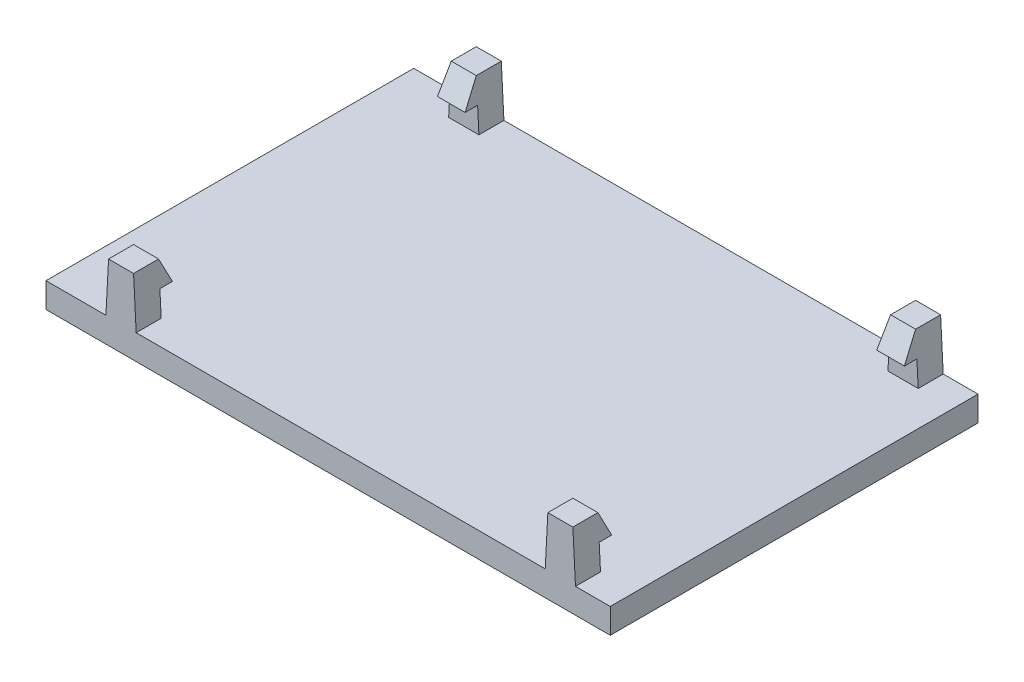
ISO-10303-21;
HEADER;
FILE_DESCRIPTION(('STEP AP214'),'2;1');
FILE_NAME('part.step','',(''),(''),'','','');
FILE_SCHEMA(('AUTOMOTIVE_DESIGN { 1 0 10303 214 1 1 1 1 }'));
ENDSEC;
DATA;
#1=APPLICATION_CONTEXT('core data for automotive mechanical design processes');
#2=APPLICATION_PROTOCOL_DEFINITION('international standard','automotive_design',2000,#1);
#3=PRODUCT_CONTEXT('',#1,'mechanical');
#4=PRODUCT('Part','Part','',(#3));
#5=PRODUCT_RELATED_PRODUCT_CATEGORY('part','',(#4));
#6=PRODUCT_DEFINITION_FORMATION('','',#4);
#7=PRODUCT_DEFINITION_CONTEXT('part definition',#1,'design');
#8=PRODUCT_DEFINITION('design','',#6,#7);
#9=PRODUCT_DEFINITION_SHAPE('','',#8);
#10=(LENGTH_UNIT() NAMED_UNIT(*) SI_UNIT(.MILLI.,.METRE.));
#11=(NAMED_UNIT(*) PLANE_ANGLE_UNIT() SI_UNIT($,.RADIAN.));
#12=(NAMED_UNIT(*) SI_UNIT($,.STERADIAN.) SOLID_ANGLE_UNIT());
#13=UNCERTAINTY_MEASURE_WITH_UNIT(LENGTH_MEASURE(1.E-05),#10,'distance_accuracy_value','');
#14=(GEOMETRIC_REPRESENTATION_CONTEXT(3) GLOBAL_UNCERTAINTY_ASSIGNED_CONTEXT((#13)) GLOBAL_UNIT_ASSIGNED_CONTEXT((#10,
#11,#12)) REPRESENTATION_CONTEXT('',''));
#15=CARTESIAN_POINT('',(0.,0.,0.));
#16=DIRECTION('',(0.,0.,1.));
#17=DIRECTION('',(1.,0.,0.));
#18=AXIS2_PLACEMENT_3D('',#15,#16,#17);
#19=CARTESIAN_POINT('',(0.,1.,0.));
#20=DIRECTION('',(0.,1.,0.));
#21=DIRECTION('',(0.,0.,1.));
#22=AXIS2_PLACEMENT_3D('',#19,#20,#21);
#23=PLANE('',#22);
#24=DIRECTION('',(0.,0.,-1.));
#25=VECTOR('',#24,1.);
#26=CARTESIAN_POINT('',(-26.6896558318944,1.,34.9634280180762));
#27=LINE('',#26,#25);
#28=CARTESIAN_POINT('',(-26.6896558318944,1.,34.9634280180762));
#29=VERTEX_POINT('',#28);
#30=CARTESIAN_POINT('',(-26.6896558318944,1.,33.9634280180762));
#31=VERTEX_POINT('',#30);
#32=EDGE_CURVE('E50',#29,#31,#27,.T.);
#33=ORIENTED_EDGE('',*,*,#32,.T.);
#34=DIRECTION('',(1.,0.,0.));
#35=VECTOR('',#34,1.);
#36=CARTESIAN_POINT('',(-26.0848402733283,1.,33.9634280180762));
#37=LINE('',#36,#35);
#38=CARTESIAN_POINT('',(-25.4800247147623,1.,33.9634280180762));
#39=VERTEX_POINT('',#38);
#40=EDGE_CURVE('E54',#31,#39,#37,.T.);
#41=ORIENTED_EDGE('',*,*,#40,.T.);
#42=DIRECTION('',(0.,0.,1.));
#43=VECTOR('',#42,1.);
#44=CARTESIAN_POINT('',(-25.4800247147623,1.,34.9634280180762));
#45=LINE('',#44,#43);
#46=CARTESIAN_POINT('',(-25.4800247147623,1.,34.9634280180762));
#47=VERTEX_POINT('',#46);
#48=EDGE_CURVE('E250',#39,#47,#45,.T.);
#49=ORIENTED_EDGE('',*,*,#48,.T.);
#50=DIRECTION('',(1.,0.,0.));
#51=VECTOR('',#50,1.);
#52=CARTESIAN_POINT('',(-46.6448402733285,1.,34.9634280180762));
#53=LINE('',#52,#51);
#54=CARTESIAN_POINT('',(-24.0896402733285,1.,34.9634280180762));
#55=VERTEX_POINT('',#54);
#56=EDGE_CURVE('E409',#47,#55,#53,.T.);
#57=ORIENTED_EDGE('',*,*,#56,.T.);
#58=DIRECTION('',(0.,0.,-1.));
#59=VECTOR('',#58,1.);
#60=CARTESIAN_POINT('',(-24.0896402733285,1.,20.2634280180762));
#61=LINE('',#60,#59);
#62=CARTESIAN_POINT('',(-24.0896402733285,1.,20.2634280180762));
#63=VERTEX_POINT('',#62);
#64=EDGE_CURVE('E413',#55,#63,#61,.T.);
#65=ORIENTED_EDGE('',*,*,#64,.T.);
#66=DIRECTION('',(-1.,0.,0.));
#67=VECTOR('',#66,1.);
#68=CARTESIAN_POINT('',(-46.6448402733285,1.,20.2634280180762));
#69=LINE('',#68,#67);
#70=CARTESIAN_POINT('',(-25.4800247147624,1.,20.2634280180762));
#71=VERTEX_POINT('',#70);
#72=EDGE_CURVE('E423',#63,#71,#69,.T.);
#73=ORIENTED_EDGE('',*,*,#72,.T.);
#74=DIRECTION('',(0.,0.,1.));
#75=VECTOR('',#74,1.);
#76=CARTESIAN_POINT('',(-25.4800247147624,1.,20.2634280180762));
#77=LINE('',#76,#75);
#78=CARTESIAN_POINT('',(-25.4800247147624,1.,21.2634280180762));
#79=VERTEX_POINT('',#78);
#80=EDGE_CURVE('E331',#71,#79,#77,.T.);
#81=ORIENTED_EDGE('',*,*,#80,.T.);
#82=DIRECTION('',(-1.,0.,0.));
#83=VECTOR('',#82,1.);
#84=CARTESIAN_POINT('',(-26.0848402733285,1.,21.2634280180762));
#85=LINE('',#84,#83);
#86=CARTESIAN_POINT('',(-26.6896558318946,1.,21.2634280180762));
#87=VERTEX_POINT('',#86);
#88=EDGE_CURVE('E320',#79,#87,#85,.T.);
#89=ORIENTED_EDGE('',*,*,#88,.T.);
#90=DIRECTION('',(0.,0.,-1.));
#91=VECTOR('',#90,1.);
#92=CARTESIAN_POINT('',(-26.6896558318946,1.,20.2634280180762));
#93=LINE('',#92,#91);
#94=CARTESIAN_POINT('',(-26.6896558318946,0.999999999999999,20.2634280180762));
#95=VERTEX_POINT('',#94);
#96=EDGE_CURVE('E316',#87,#95,#93,.T.);
#97=ORIENTED_EDGE('',*,*,#96,.T.);
#98=CARTESIAN_POINT('',(-43.0400247147624,1.,20.2634280180762));
#99=VERTEX_POINT('',#98);
#100=EDGE_CURVE('E36',#95,#99,#69,.T.);
#101=ORIENTED_EDGE('',*,*,#100,.T.);
#102=DIRECTION('',(0.,0.,1.));
#103=VECTOR('',#102,1.);
#104=CARTESIAN_POINT('',(-43.0400247147624,1.,20.2634280180762));
#105=LINE('',#104,#103);
#106=CARTESIAN_POINT('',(-43.0400247147624,1.,21.2634280180762));
#107=VERTEX_POINT('',#106);
#108=EDGE_CURVE('E374',#99,#107,#105,.T.);
#109=ORIENTED_EDGE('',*,*,#108,.T.);
#110=DIRECTION('',(-1.,0.,0.));
#111=VECTOR('',#110,1.);
#112=CARTESIAN_POINT('',(-43.6448402733285,1.,21.2634280180762));
#113=LINE('',#112,#111);
#114=CARTESIAN_POINT('',(-44.2496558318946,0.999999999999999,21.2634280180762));
#115=VERTEX_POINT('',#114);
#116=EDGE_CURVE('E371',#107,#115,#113,.T.);
#117=ORIENTED_EDGE('',*,*,#116,.T.);
#118=DIRECTION('',(0.,0.,-1.));
#119=VECTOR('',#118,1.);
#120=CARTESIAN_POINT('',(-44.2496558318946,1.,20.2634280180762));
#121=LINE('',#120,#119);
#122=CARTESIAN_POINT('',(-44.2496558318946,1.,20.2634280180762));
#123=VERTEX_POINT('',#122);
#124=EDGE_CURVE('E366',#115,#123,#121,.T.);
#125=ORIENTED_EDGE('',*,*,#124,.T.);
#126=CARTESIAN_POINT('',(-46.6448402733285,1.,20.2634280180762));
#127=VERTEX_POINT('',#126);
#128=EDGE_CURVE('E415',#123,#127,#69,.T.);
#129=ORIENTED_EDGE('',*,*,#128,.T.);
#130=DIRECTION('',(0.,0.,1.));
#131=VECTOR('',#130,1.);
#132=CARTESIAN_POINT('',(-46.6448402733285,1.,20.2634280180762));
#133=LINE('',#132,#131);
#134=CARTESIAN_POINT('',(-46.6448402733285,1.,34.9634280180762));
#135=VERTEX_POINT('',#134);
#136=EDGE_CURVE('E406',#127,#135,#133,.T.);
#137=ORIENTED_EDGE('',*,*,#136,.T.);
#138=CARTESIAN_POINT('',(-44.2496558318944,1.,34.9634280180762));
#139=VERTEX_POINT('',#138);
#140=EDGE_CURVE('E411',#135,#139,#53,.T.);
#141=ORIENTED_EDGE('',*,*,#140,.T.);
#142=DIRECTION('',(0.,0.,-1.));
#143=VECTOR('',#142,1.);
#144=CARTESIAN_POINT('',(-44.2496558318944,1.,34.9634280180762));
#145=LINE('',#144,#143);
#146=CARTESIAN_POINT('',(-44.2496558318944,1.,33.9634280180762));
#147=VERTEX_POINT('',#146);
#148=EDGE_CURVE('E285',#139,#147,#145,.T.);
#149=ORIENTED_EDGE('',*,*,#148,.T.);
#150=DIRECTION('',(1.,0.,0.));
#151=VECTOR('',#150,1.);
#152=CARTESIAN_POINT('',(-43.6448402733283,1.,33.9634280180762));
#153=LINE('',#152,#151);
#154=CARTESIAN_POINT('',(-43.0400247147623,1.,33.9634280180762));
#155=VERTEX_POINT('',#154);
#156=EDGE_CURVE('E274',#147,#155,#153,.T.);
#157=ORIENTED_EDGE('',*,*,#156,.T.);
#158=DIRECTION('',(0.,0.,1.));
#159=VECTOR('',#158,1.);
#160=CARTESIAN_POINT('',(-43.0400247147623,1.,34.9634280180762));
#161=LINE('',#160,#159);
#162=CARTESIAN_POINT('',(-43.0400247147623,1.,34.9634280180762));
#163=VERTEX_POINT('',#162);
#164=EDGE_CURVE('E270',#155,#163,#161,.T.);
#165=ORIENTED_EDGE('',*,*,#164,.T.);
#166=EDGE_CURVE('E414',#163,#29,#53,.T.);
#167=ORIENTED_EDGE('',*,*,#166,.T.);
#168=EDGE_LOOP('',(#33,#41,#49,#57,#65,#73,#81,#89,#97,#101,#109,#117,#125,#129,#137,#141,#149,
#157,#165,#167));
#169=FACE_BOUND('',#168,.T.);
#170=ADVANCED_FACE('F32',(#169),#23,.T.);
#171=CARTESIAN_POINT('',(-46.6448402733285,1.,20.2634280180762));
#172=DIRECTION('',(1.,0.,0.));
#173=DIRECTION('',(0.,0.,-1.));
#174=AXIS2_PLACEMENT_3D('',#171,#172,#173);
#175=PLANE('',#174);
#176=DIRECTION('',(0.,0.,1.));
#177=VECTOR('',#176,1.);
#178=CARTESIAN_POINT('',(-46.6448402733285,0.,20.2634280180762));
#179=LINE('',#178,#177);
#180=CARTESIAN_POINT('',(-46.6448402733285,0.,20.2634280180762));
#181=VERTEX_POINT('',#180);
#182=CARTESIAN_POINT('',(-46.6448402733285,0.,34.9634280180762));
#183=VERTEX_POINT('',#182);
#184=EDGE_CURVE('E370',#181,#183,#179,.T.);
#185=ORIENTED_EDGE('',*,*,#184,.T.);
#186=DIRECTION('',(0.,-1.,0.));
#187=VECTOR('',#186,1.);
#188=CARTESIAN_POINT('',(-46.6448402733285,1.,34.9634280180762));
#189=LINE('',#188,#187);
#190=EDGE_CURVE('E11',#135,#183,#189,.T.);
#191=ORIENTED_EDGE('',*,*,#190,.F.);
#192=ORIENTED_EDGE('',*,*,#136,.F.);
#193=DIRECTION('',(0.,-1.,0.));
#194=VECTOR('',#193,1.);
#195=CARTESIAN_POINT('',(-46.6448402733285,1.,20.2634280180762));
#196=LINE('',#195,#194);
#197=EDGE_CURVE('E424',#127,#181,#196,.T.);
#198=ORIENTED_EDGE('',*,*,#197,.T.);
#199=EDGE_LOOP('',(#185,#191,#192,#198));
#200=FACE_BOUND('',#199,.T.);
#201=ADVANCED_FACE('F34',(#200),#175,.F.);
#202=CARTESIAN_POINT('',(-46.6448402733285,1.,34.9634280180762));
#203=DIRECTION('',(0.,0.,-1.));
#204=DIRECTION('',(-1.,0.,0.));
#205=AXIS2_PLACEMENT_3D('',#202,#203,#204);
#206=PLANE('',#205);
#207=DIRECTION('',(1.,0.,0.));
#208=VECTOR('',#207,1.);
#209=CARTESIAN_POINT('',(-46.6448402733285,0.,34.9634280180762));
#210=LINE('',#209,#208);
#211=CARTESIAN_POINT('',(-24.0896402733285,0.,34.9634280180762));
#212=VERTEX_POINT('',#211);
#213=EDGE_CURVE('E435',#183,#212,#210,.T.);
#214=ORIENTED_EDGE('',*,*,#213,.T.);
#215=DIRECTION('',(0.,-1.,0.));
#216=VECTOR('',#215,1.);
#217=CARTESIAN_POINT('',(-24.0896402733285,1.,34.9634280180762));
#218=LINE('',#217,#216);
#219=EDGE_CURVE('E42',#55,#212,#218,.T.);
#220=ORIENTED_EDGE('',*,*,#219,.F.);
#221=ORIENTED_EDGE('',*,*,#56,.F.);
#222=DIRECTION('',(-0.0523359562429438,0.998629534754574,0.));
#223=VECTOR('',#222,1.);
#224=CARTESIAN_POINT('',(-25.5848402733283,3.,34.9634280180762));
#225=LINE('',#224,#223);
#226=CARTESIAN_POINT('',(-25.5848402733283,3.,34.9634280180762));
#227=VERTEX_POINT('',#226);
#228=EDGE_CURVE('E260',#47,#227,#225,.T.);
#229=ORIENTED_EDGE('',*,*,#228,.T.);
#230=DIRECTION('',(-1.,0.,0.));
#231=VECTOR('',#230,1.);
#232=CARTESIAN_POINT('',(-26.0848402733283,3.,34.9634280180762));
#233=LINE('',#232,#231);
#234=CARTESIAN_POINT('',(-26.5848402733283,3.,34.9634280180762));
#235=VERTEX_POINT('',#234);
#236=EDGE_CURVE('E247',#227,#235,#233,.T.);
#237=ORIENTED_EDGE('',*,*,#236,.T.);
#238=DIRECTION('',(-0.0523359562429438,-0.998629534754574,0.));
#239=VECTOR('',#238,1.);
#240=CARTESIAN_POINT('',(-26.5848402733283,3.,34.9634280180762));
#241=LINE('',#240,#239);
#242=EDGE_CURVE('E244',#235,#29,#241,.T.);
#243=ORIENTED_EDGE('',*,*,#242,.T.);
#244=ORIENTED_EDGE('',*,*,#166,.F.);
#245=DIRECTION('',(-0.0523359562429438,0.998629534754574,0.));
#246=VECTOR('',#245,1.);
#247=CARTESIAN_POINT('',(-43.1448402733283,3.,34.9634280180762));
#248=LINE('',#247,#246);
#249=CARTESIAN_POINT('',(-43.1448402733283,3.,34.9634280180762));
#250=VERTEX_POINT('',#249);
#251=EDGE_CURVE('E301',#163,#250,#248,.T.);
#252=ORIENTED_EDGE('',*,*,#251,.T.);
#253=DIRECTION('',(-1.,0.,0.));
#254=VECTOR('',#253,1.);
#255=CARTESIAN_POINT('',(-43.6448402733283,3.,34.9634280180762));
#256=LINE('',#255,#254);
#257=CARTESIAN_POINT('',(-44.1448402733283,3.,34.9634280180762));
#258=VERTEX_POINT('',#257);
#259=EDGE_CURVE('E302',#250,#258,#256,.T.);
#260=ORIENTED_EDGE('',*,*,#259,.T.);
#261=DIRECTION('',(-0.0523359562429438,-0.998629534754574,0.));
#262=VECTOR('',#261,1.);
#263=CARTESIAN_POINT('',(-44.1448402733283,3.,34.9634280180762));
#264=LINE('',#263,#262);
#265=EDGE_CURVE('E279',#258,#139,#264,.T.);
#266=ORIENTED_EDGE('',*,*,#265,.T.);
#267=ORIENTED_EDGE('',*,*,#140,.F.);
#268=ORIENTED_EDGE('',*,*,#190,.T.);
#269=EDGE_LOOP('',(#214,#220,#221,#229,#237,#243,#244,#252,#260,#266,#267,#268));
#270=FACE_BOUND('',#269,.T.);
#271=ADVANCED_FACE('F448',(#270),#206,.F.);
#272=CARTESIAN_POINT('',(-24.0896402733285,1.,20.2634280180762));
#273=DIRECTION('',(-1.,0.,0.));
#274=DIRECTION('',(0.,0.,1.));
#275=AXIS2_PLACEMENT_3D('',#272,#273,#274);
#276=PLANE('',#275);
#277=DIRECTION('',(0.,0.,-1.));
#278=VECTOR('',#277,1.);
#279=CARTESIAN_POINT('',(-24.0896402733285,0.,20.2634280180762));
#280=LINE('',#279,#278);
#281=CARTESIAN_POINT('',(-24.0896402733285,0.,20.2634280180762));
#282=VERTEX_POINT('',#281);
#283=EDGE_CURVE('E434',#212,#282,#280,.T.);
#284=ORIENTED_EDGE('',*,*,#283,.T.);
#285=DIRECTION('',(0.,-1.,0.));
#286=VECTOR('',#285,1.);
#287=CARTESIAN_POINT('',(-24.0896402733285,1.,20.2634280180762));
#288=LINE('',#287,#286);
#289=EDGE_CURVE('E428',#63,#282,#288,.T.);
#290=ORIENTED_EDGE('',*,*,#289,.F.);
#291=ORIENTED_EDGE('',*,*,#64,.F.);
#292=ORIENTED_EDGE('',*,*,#219,.T.);
#293=EDGE_LOOP('',(#284,#290,#291,#292));
#294=FACE_BOUND('',#293,.T.);
#295=ADVANCED_FACE('F457',(#294),#276,.F.);
#296=CARTESIAN_POINT('',(-46.6448402733285,1.,20.2634280180762));
#297=DIRECTION('',(0.,0.,1.));
#298=DIRECTION('',(1.,0.,0.));
#299=AXIS2_PLACEMENT_3D('',#296,#297,#298);
#300=PLANE('',#299);
#301=DIRECTION('',(-1.,0.,0.));
#302=VECTOR('',#301,1.);
#303=CARTESIAN_POINT('',(-46.6448402733285,0.,20.2634280180762));
#304=LINE('',#303,#302);
#305=EDGE_CURVE('E410',#282,#181,#304,.T.);
#306=ORIENTED_EDGE('',*,*,#305,.T.);
#307=ORIENTED_EDGE('',*,*,#197,.F.);
#308=ORIENTED_EDGE('',*,*,#128,.F.);
#309=DIRECTION('',(0.0523359562429438,0.998629534754574,0.));
#310=VECTOR('',#309,1.);
#311=CARTESIAN_POINT('',(-44.1448402733285,3.,20.2634280180762));
#312=LINE('',#311,#310);
#313=CARTESIAN_POINT('',(-44.1448402733285,3.,20.2634280180762));
#314=VERTEX_POINT('',#313);
#315=EDGE_CURVE('E388',#123,#314,#312,.T.);
#316=ORIENTED_EDGE('',*,*,#315,.T.);
#317=DIRECTION('',(1.,0.,0.));
#318=VECTOR('',#317,1.);
#319=CARTESIAN_POINT('',(-43.6448402733285,3.,20.2634280180762));
#320=LINE('',#319,#318);
#321=CARTESIAN_POINT('',(-43.1448402733285,3.,20.2634280180762));
#322=VERTEX_POINT('',#321);
#323=EDGE_CURVE('E382',#314,#322,#320,.T.);
#324=ORIENTED_EDGE('',*,*,#323,.T.);
#325=DIRECTION('',(0.0523359562429438,-0.998629534754574,0.));
#326=VECTOR('',#325,1.);
#327=CARTESIAN_POINT('',(-43.1448402733285,3.,20.2634280180762));
#328=LINE('',#327,#326);
#329=EDGE_CURVE('E380',#322,#99,#328,.T.);
#330=ORIENTED_EDGE('',*,*,#329,.T.);
#331=ORIENTED_EDGE('',*,*,#100,.F.);
#332=DIRECTION('',(0.0523359562429438,0.998629534754574,0.));
#333=VECTOR('',#332,1.);
#334=CARTESIAN_POINT('',(-26.5848402733285,3.,20.2634280180762));
#335=LINE('',#334,#333);
#336=CARTESIAN_POINT('',(-26.5848402733285,3.,20.2634280180762));
#337=VERTEX_POINT('',#336);
#338=EDGE_CURVE('E347',#95,#337,#335,.T.);
#339=ORIENTED_EDGE('',*,*,#338,.T.);
#340=DIRECTION('',(1.,0.,0.));
#341=VECTOR('',#340,1.);
#342=CARTESIAN_POINT('',(-26.0848402733285,3.,20.2634280180762));
#343=LINE('',#342,#341);
#344=CARTESIAN_POINT('',(-25.5848402733285,3.,20.2634280180762));
#345=VERTEX_POINT('',#344);
#346=EDGE_CURVE('E348',#337,#345,#343,.T.);
#347=ORIENTED_EDGE('',*,*,#346,.T.);
#348=DIRECTION('',(0.0523359562429438,-0.998629534754574,0.));
#349=VECTOR('',#348,1.);
#350=CARTESIAN_POINT('',(-25.5848402733285,3.,20.2634280180762));
#351=LINE('',#350,#349);
#352=EDGE_CURVE('E325',#345,#71,#351,.T.);
#353=ORIENTED_EDGE('',*,*,#352,.T.);
#354=ORIENTED_EDGE('',*,*,#72,.F.);
#355=ORIENTED_EDGE('',*,*,#289,.T.);
#356=EDGE_LOOP('',(#306,#307,#308,#316,#324,#330,#331,#339,#347,#353,#354,#355));
#357=FACE_BOUND('',#356,.T.);
#358=ADVANCED_FACE('F452',(#357),#300,.F.);
#359=CARTESIAN_POINT('',(0.,0.,0.));
#360=DIRECTION('',(0.,1.,0.));
#361=DIRECTION('',(0.,0.,1.));
#362=AXIS2_PLACEMENT_3D('',#359,#360,#361);
#363=PLANE('',#362);
#364=ORIENTED_EDGE('',*,*,#184,.F.);
#365=ORIENTED_EDGE('',*,*,#305,.F.);
#366=ORIENTED_EDGE('',*,*,#283,.F.);
#367=ORIENTED_EDGE('',*,*,#213,.F.);
#368=EDGE_LOOP('',(#364,#365,#366,#367));
#369=FACE_BOUND('',#368,.T.);
#370=ADVANCED_FACE('F446',(#369),#363,.F.);
#371=CARTESIAN_POINT('',(-43.6448402733285,-498.,21.2634280180762));
#372=DIRECTION('',(0.,0.,1.));
#373=DIRECTION('',(-1.,0.,0.));
#374=AXIS2_PLACEMENT_3D('',#371,#372,#373);
#375=PLANE('',#374);
#376=ORIENTED_EDGE('',*,*,#116,.F.);
#377=DIRECTION('',(-0.0523359562429438,0.998629534754574,0.));
#378=VECTOR('',#377,1.);
#379=CARTESIAN_POINT('',(-43.1448402733285,3.,21.2634280180762));
#380=LINE('',#379,#378);
#381=CARTESIAN_POINT('',(-43.0924324940455,2.,21.2634280180762));
#382=VERTEX_POINT('',#381);
#383=EDGE_CURVE('E319',#107,#382,#380,.T.);
#384=ORIENTED_EDGE('',*,*,#383,.T.);
#385=DIRECTION('',(-1.,0.,0.));
#386=VECTOR('',#385,1.);
#387=CARTESIAN_POINT('',(-43.6448402733285,2.,21.2634280180762));
#388=LINE('',#387,#386);
#389=CARTESIAN_POINT('',(-44.1972480526115,2.,21.2634280180762));
#390=VERTEX_POINT('',#389);
#391=EDGE_CURVE('E396',#382,#390,#388,.T.);
#392=ORIENTED_EDGE('',*,*,#391,.T.);
#393=DIRECTION('',(-0.0523359562429438,-0.998629534754574,0.));
#394=VECTOR('',#393,1.);
#395=CARTESIAN_POINT('',(-44.1448402733285,3.,21.2634280180762));
#396=LINE('',#395,#394);
#397=EDGE_CURVE('E399',#390,#115,#396,.T.);
#398=ORIENTED_EDGE('',*,*,#397,.T.);
#399=EDGE_LOOP('',(#376,#384,#392,#398));
#400=FACE_BOUND('',#399,.T.);
#401=ADVANCED_FACE('F487',(#400),#375,.T.);
#402=CARTESIAN_POINT('',(-43.1448402733285,3.,20.2634280180762));
#403=DIRECTION('',(0.998629534754574,0.0523359562429438,0.));
#404=DIRECTION('',(0.0523359562429438,-0.998629534754574,0.));
#405=AXIS2_PLACEMENT_3D('',#402,#403,#404);
#406=PLANE('',#405);
#407=ORIENTED_EDGE('',*,*,#108,.F.);
#408=ORIENTED_EDGE('',*,*,#329,.F.);
#409=DIRECTION('',(0.,0.,1.));
#410=VECTOR('',#409,1.);
#411=CARTESIAN_POINT('',(-43.1448402733285,3.,20.2634280180762));
#412=LINE('',#411,#410);
#413=CARTESIAN_POINT('',(-43.1448402733285,3.,21.2634280180762));
#414=VERTEX_POINT('',#413);
#415=EDGE_CURVE('E405',#322,#414,#412,.T.);
#416=ORIENTED_EDGE('',*,*,#415,.T.);
#417=DIRECTION('',(-0.0468235292972341,0.893446162722366,-0.446723081361183));
#418=VECTOR('',#417,1.);
#419=CARTESIAN_POINT('',(-43.1657574246164,3.39912302284166,21.0638665066554));
#420=LINE('',#419,#418);
#421=CARTESIAN_POINT('',(-43.0924324940455,2.,21.7634280180762));
#422=VERTEX_POINT('',#421);
#423=EDGE_CURVE('E862',#422,#414,#420,.T.);
#424=ORIENTED_EDGE('',*,*,#423,.F.);
#425=DIRECTION('',(0.,0.,1.));
#426=VECTOR('',#425,1.);
#427=CARTESIAN_POINT('',(-43.0924324940455,2.,20.2634280180762));
#428=LINE('',#427,#426);
#429=EDGE_CURVE('E377',#382,#422,#428,.T.);
#430=ORIENTED_EDGE('',*,*,#429,.F.);
#431=ORIENTED_EDGE('',*,*,#383,.F.);
#432=EDGE_LOOP('',(#407,#408,#416,#424,#430,#431));
#433=FACE_BOUND('',#432,.T.);
#434=ADVANCED_FACE('F519',(#433),#406,.T.);
#435=CARTESIAN_POINT('',(-43.6448402733285,3.,20.2634280180762));
#436=DIRECTION('',(0.,1.,0.));
#437=DIRECTION('',(0.,0.,1.));
#438=AXIS2_PLACEMENT_3D('',#435,#436,#437);
#439=PLANE('',#438);
#440=ORIENTED_EDGE('',*,*,#415,.F.);
#441=ORIENTED_EDGE('',*,*,#323,.F.);
#442=DIRECTION('',(0.,0.,1.));
#443=VECTOR('',#442,1.);
#444=CARTESIAN_POINT('',(-44.1448402733285,3.,20.2634280180762));
#445=LINE('',#444,#443);
#446=CARTESIAN_POINT('',(-44.1448402733285,3.,21.2634280180762));
#447=VERTEX_POINT('',#446);
#448=EDGE_CURVE('E392',#314,#447,#445,.T.);
#449=ORIENTED_EDGE('',*,*,#448,.T.);
#450=DIRECTION('',(-1.,0.,0.));
#451=VECTOR('',#450,1.);
#452=CARTESIAN_POINT('',(-43.6448402733285,3.,21.2634280180762));
#453=LINE('',#452,#451);
#454=EDGE_CURVE('E858',#414,#447,#453,.T.);
#455=ORIENTED_EDGE('',*,*,#454,.F.);
#456=EDGE_LOOP('',(#440,#441,#449,#455));
#457=FACE_BOUND('',#456,.T.);
#458=ADVANCED_FACE('F526',(#457),#439,.T.);
#459=CARTESIAN_POINT('',(-44.1448402733285,3.,20.2634280180762));
#460=DIRECTION('',(-0.998629534754574,0.0523359562429438,0.));
#461=DIRECTION('',(0.0523359562429438,0.998629534754574,0.));
#462=AXIS2_PLACEMENT_3D('',#459,#460,#461);
#463=PLANE('',#462);
#464=ORIENTED_EDGE('',*,*,#124,.F.);
#465=ORIENTED_EDGE('',*,*,#397,.F.);
#466=DIRECTION('',(0.,0.,1.));
#467=VECTOR('',#466,1.);
#468=CARTESIAN_POINT('',(-44.1972480526115,2.,21.2634280180762));
#469=LINE('',#468,#467);
#470=CARTESIAN_POINT('',(-44.1972480526115,2.,21.7634280180762));
#471=VERTEX_POINT('',#470);
#472=EDGE_CURVE('E363',#390,#471,#469,.T.);
#473=ORIENTED_EDGE('',*,*,#472,.T.);
#474=DIRECTION('',(-0.0468235292972336,-0.893446162722366,0.446723081361183));
#475=VECTOR('',#474,1.);
#476=CARTESIAN_POINT('',(-44.1239231220406,3.39912302284166,21.0638665066554));
#477=LINE('',#476,#475);
#478=EDGE_CURVE('E856',#447,#471,#477,.T.);
#479=ORIENTED_EDGE('',*,*,#478,.F.);
#480=ORIENTED_EDGE('',*,*,#448,.F.);
#481=ORIENTED_EDGE('',*,*,#315,.F.);
#482=EDGE_LOOP('',(#464,#465,#473,#479,#480,#481));
#483=FACE_BOUND('',#482,.T.);
#484=ADVANCED_FACE('F533',(#483),#463,.T.);
#485=CARTESIAN_POINT('',(-43.6448402733285,3.,21.2634280180762));
#486=DIRECTION('',(0.,0.447213595499958,0.894427190999916));
#487=DIRECTION('',(0.,-0.894427190999916,0.447213595499958));
#488=AXIS2_PLACEMENT_3D('',#485,#486,#487);
#489=PLANE('',#488);
#490=DIRECTION('',(1.,0.,0.));
#491=VECTOR('',#490,1.);
#492=CARTESIAN_POINT('',(-43.6448402733285,2.,21.7634280180762));
#493=LINE('',#492,#491);
#494=EDGE_CURVE('E387',#471,#422,#493,.T.);
#495=ORIENTED_EDGE('',*,*,#494,.T.);
#496=ORIENTED_EDGE('',*,*,#423,.T.);
#497=ORIENTED_EDGE('',*,*,#454,.T.);
#498=ORIENTED_EDGE('',*,*,#478,.T.);
#499=EDGE_LOOP('',(#495,#496,#497,#498));
#500=FACE_BOUND('',#499,.T.);
#501=ADVANCED_FACE('F541',(#500),#489,.T.);
#502=CARTESIAN_POINT('',(-43.6448402733285,2.,21.2634280180762));
#503=DIRECTION('',(0.,-1.,0.));
#504=DIRECTION('',(0.,0.,-1.));
#505=AXIS2_PLACEMENT_3D('',#502,#503,#504);
#506=PLANE('',#505);
#507=ORIENTED_EDGE('',*,*,#429,.T.);
#508=ORIENTED_EDGE('',*,*,#494,.F.);
#509=ORIENTED_EDGE('',*,*,#472,.F.);
#510=ORIENTED_EDGE('',*,*,#391,.F.);
#511=EDGE_LOOP('',(#507,#508,#509,#510));
#512=FACE_BOUND('',#511,.T.);
#513=ADVANCED_FACE('F549',(#512),#506,.T.);
#514=CARTESIAN_POINT('',(-26.0848402733285,-498.,21.2634280180762));
#515=DIRECTION('',(0.,0.,1.));
#516=DIRECTION('',(-1.,0.,0.));
#517=AXIS2_PLACEMENT_3D('',#514,#515,#516);
#518=PLANE('',#517);
#519=ORIENTED_EDGE('',*,*,#88,.F.);
#520=DIRECTION('',(-0.0523359562429438,0.998629534754574,0.));
#521=VECTOR('',#520,1.);
#522=CARTESIAN_POINT('',(-25.5848402733285,3.,21.2634280180762));
#523=LINE('',#522,#521);
#524=CARTESIAN_POINT('',(-25.5324324940455,2.,21.2634280180762));
#525=VERTEX_POINT('',#524);
#526=EDGE_CURVE('E273',#79,#525,#523,.T.);
#527=ORIENTED_EDGE('',*,*,#526,.T.);
#528=DIRECTION('',(-1.,0.,0.));
#529=VECTOR('',#528,1.);
#530=CARTESIAN_POINT('',(-26.0848402733285,2.,21.2634280180762));
#531=LINE('',#530,#529);
#532=CARTESIAN_POINT('',(-26.6372480526115,2.,21.2634280180762));
#533=VERTEX_POINT('',#532);
#534=EDGE_CURVE('E350',#525,#533,#531,.T.);
#535=ORIENTED_EDGE('',*,*,#534,.T.);
#536=DIRECTION('',(-0.0523359562429438,-0.998629534754574,0.));
#537=VECTOR('',#536,1.);
#538=CARTESIAN_POINT('',(-26.5848402733285,3.,21.2634280180762));
#539=LINE('',#538,#537);
#540=EDGE_CURVE('E344',#533,#87,#539,.T.);
#541=ORIENTED_EDGE('',*,*,#540,.T.);
#542=EDGE_LOOP('',(#519,#527,#535,#541));
#543=FACE_BOUND('',#542,.T.);
#544=ADVANCED_FACE('F556',(#543),#518,.T.);
#545=CARTESIAN_POINT('',(-25.5848402733285,3.,20.2634280180762));
#546=DIRECTION('',(0.998629534754574,0.0523359562429438,0.));
#547=DIRECTION('',(0.0523359562429438,-0.998629534754574,0.));
#548=AXIS2_PLACEMENT_3D('',#545,#546,#547);
#549=PLANE('',#548);
#550=ORIENTED_EDGE('',*,*,#80,.F.);
#551=ORIENTED_EDGE('',*,*,#352,.F.);
#552=DIRECTION('',(0.,0.,1.));
#553=VECTOR('',#552,1.);
#554=CARTESIAN_POINT('',(-25.5848402733285,3.,20.2634280180762));
#555=LINE('',#554,#553);
#556=CARTESIAN_POINT('',(-25.5848402733285,3.,21.2634280180762));
#557=VERTEX_POINT('',#556);
#558=EDGE_CURVE('E340',#345,#557,#555,.T.);
#559=ORIENTED_EDGE('',*,*,#558,.T.);
#560=DIRECTION('',(-0.0468235292972341,0.893446162722366,-0.446723081361183));
#561=VECTOR('',#560,1.);
#562=CARTESIAN_POINT('',(-25.6057574246164,3.39912302284166,21.0638665066554));
#563=LINE('',#562,#561);
#564=CARTESIAN_POINT('',(-25.5324324940455,2.,21.7634280180762));
#565=VERTEX_POINT('',#564);
#566=EDGE_CURVE('E327',#565,#557,#563,.T.);
#567=ORIENTED_EDGE('',*,*,#566,.F.);
#568=DIRECTION('',(0.,0.,1.));
#569=VECTOR('',#568,1.);
#570=CARTESIAN_POINT('',(-25.5324324940455,2.,20.2634280180762));
#571=LINE('',#570,#569);
#572=EDGE_CURVE('E328',#525,#565,#571,.T.);
#573=ORIENTED_EDGE('',*,*,#572,.F.);
#574=ORIENTED_EDGE('',*,*,#526,.F.);
#575=EDGE_LOOP('',(#550,#551,#559,#567,#573,#574));
#576=FACE_BOUND('',#575,.T.);
#577=ADVANCED_FACE('F563',(#576),#549,.T.);
#578=CARTESIAN_POINT('',(-26.0848402733285,3.,20.2634280180762));
#579=DIRECTION('',(0.,1.,0.));
#580=DIRECTION('',(0.,0.,1.));
#581=AXIS2_PLACEMENT_3D('',#578,#579,#580);
#582=PLANE('',#581);
#583=ORIENTED_EDGE('',*,*,#558,.F.);
#584=ORIENTED_EDGE('',*,*,#346,.F.);
#585=DIRECTION('',(0.,0.,1.));
#586=VECTOR('',#585,1.);
#587=CARTESIAN_POINT('',(-26.5848402733285,3.,20.2634280180762));
#588=LINE('',#587,#586);
#589=CARTESIAN_POINT('',(-26.5848402733285,3.,21.2634280180762));
#590=VERTEX_POINT('',#589);
#591=EDGE_CURVE('E343',#337,#590,#588,.T.);
#592=ORIENTED_EDGE('',*,*,#591,.T.);
#593=DIRECTION('',(-1.,0.,0.));
#594=VECTOR('',#593,1.);
#595=CARTESIAN_POINT('',(-26.0848402733285,3.,21.2634280180762));
#596=LINE('',#595,#594);
#597=EDGE_CURVE('E335',#557,#590,#596,.T.);
#598=ORIENTED_EDGE('',*,*,#597,.F.);
#599=EDGE_LOOP('',(#583,#584,#592,#598));
#600=FACE_BOUND('',#599,.T.);
#601=ADVANCED_FACE('F571',(#600),#582,.T.);
#602=CARTESIAN_POINT('',(-26.5848402733285,3.,20.2634280180762));
#603=DIRECTION('',(-0.998629534754574,0.0523359562429438,0.));
#604=DIRECTION('',(0.0523359562429438,0.998629534754574,0.));
#605=AXIS2_PLACEMENT_3D('',#602,#603,#604);
#606=PLANE('',#605);
#607=ORIENTED_EDGE('',*,*,#96,.F.);
#608=ORIENTED_EDGE('',*,*,#540,.F.);
#609=DIRECTION('',(0.,0.,1.));
#610=VECTOR('',#609,1.);
#611=CARTESIAN_POINT('',(-26.6372480526115,2.,21.2634280180762));
#612=LINE('',#611,#610);
#613=CARTESIAN_POINT('',(-26.6372480526115,2.,21.7634280180762));
#614=VERTEX_POINT('',#613);
#615=EDGE_CURVE('E321',#533,#614,#612,.T.);
#616=ORIENTED_EDGE('',*,*,#615,.T.);
#617=DIRECTION('',(-0.0468235292972336,-0.893446162722366,0.446723081361183));
#618=VECTOR('',#617,1.);
#619=CARTESIAN_POINT('',(-26.5639231220406,3.39912302284166,21.0638665066554));
#620=LINE('',#619,#618);
#621=EDGE_CURVE('E332',#590,#614,#620,.T.);
#622=ORIENTED_EDGE('',*,*,#621,.F.);
#623=ORIENTED_EDGE('',*,*,#591,.F.);
#624=ORIENTED_EDGE('',*,*,#338,.F.);
#625=EDGE_LOOP('',(#607,#608,#616,#622,#623,#624));
#626=FACE_BOUND('',#625,.T.);
#627=ADVANCED_FACE('F579',(#626),#606,.T.);
#628=CARTESIAN_POINT('',(-26.0848402733285,3.,21.2634280180762));
#629=DIRECTION('',(0.,0.447213595499958,0.894427190999916));
#630=DIRECTION('',(0.,-0.894427190999916,0.447213595499958));
#631=AXIS2_PLACEMENT_3D('',#628,#629,#630);
#632=PLANE('',#631);
#633=DIRECTION('',(1.,0.,0.));
#634=VECTOR('',#633,1.);
#635=CARTESIAN_POINT('',(-26.0848402733285,2.,21.7634280180762));
#636=LINE('',#635,#634);
#637=EDGE_CURVE('E324',#614,#565,#636,.T.);
#638=ORIENTED_EDGE('',*,*,#637,.T.);
#639=ORIENTED_EDGE('',*,*,#566,.T.);
#640=ORIENTED_EDGE('',*,*,#597,.T.);
#641=ORIENTED_EDGE('',*,*,#621,.T.);
#642=EDGE_LOOP('',(#638,#639,#640,#641));
#643=FACE_BOUND('',#642,.T.);
#644=ADVANCED_FACE('F587',(#643),#632,.T.);
#645=CARTESIAN_POINT('',(-26.0848402733285,2.,21.2634280180762));
#646=DIRECTION('',(0.,-1.,0.));
#647=DIRECTION('',(0.,0.,-1.));
#648=AXIS2_PLACEMENT_3D('',#645,#646,#647);
#649=PLANE('',#648);
#650=ORIENTED_EDGE('',*,*,#572,.T.);
#651=ORIENTED_EDGE('',*,*,#637,.F.);
#652=ORIENTED_EDGE('',*,*,#615,.F.);
#653=ORIENTED_EDGE('',*,*,#534,.F.);
#654=EDGE_LOOP('',(#650,#651,#652,#653));
#655=FACE_BOUND('',#654,.T.);
#656=ADVANCED_FACE('F595',(#655),#649,.T.);
#657=CARTESIAN_POINT('',(-43.6448402733283,-498.,33.9634280180762));
#658=DIRECTION('',(0.,0.,-1.));
#659=DIRECTION('',(1.,0.,0.));
#660=AXIS2_PLACEMENT_3D('',#657,#658,#659);
#661=PLANE('',#660);
#662=ORIENTED_EDGE('',*,*,#156,.F.);
#663=DIRECTION('',(0.0523359562429438,0.998629534754574,0.));
#664=VECTOR('',#663,1.);
#665=CARTESIAN_POINT('',(-44.1448402733283,3.,33.9634280180762));
#666=LINE('',#665,#664);
#667=CARTESIAN_POINT('',(-44.1972480526114,2.,33.9634280180762));
#668=VERTEX_POINT('',#667);
#669=EDGE_CURVE('E307',#147,#668,#666,.T.);
#670=ORIENTED_EDGE('',*,*,#669,.T.);
#671=DIRECTION('',(1.,0.,0.));
#672=VECTOR('',#671,1.);
#673=CARTESIAN_POINT('',(-43.6448402733283,2.,33.9634280180762));
#674=LINE('',#673,#672);
#675=CARTESIAN_POINT('',(-43.0924324940453,2.,33.9634280180762));
#676=VERTEX_POINT('',#675);
#677=EDGE_CURVE('E304',#668,#676,#674,.T.);
#678=ORIENTED_EDGE('',*,*,#677,.T.);
#679=DIRECTION('',(0.0523359562429438,-0.998629534754574,0.));
#680=VECTOR('',#679,1.);
#681=CARTESIAN_POINT('',(-43.1448402733283,3.,33.9634280180762));
#682=LINE('',#681,#680);
#683=EDGE_CURVE('E298',#676,#155,#682,.T.);
#684=ORIENTED_EDGE('',*,*,#683,.T.);
#685=EDGE_LOOP('',(#662,#670,#678,#684));
#686=FACE_BOUND('',#685,.T.);
#687=ADVANCED_FACE('F603',(#686),#661,.T.);
#688=CARTESIAN_POINT('',(-44.1448402733283,3.,34.9634280180762));
#689=DIRECTION('',(-0.998629534754574,0.0523359562429438,0.));
#690=DIRECTION('',(-0.0523359562429438,-0.998629534754574,0.));
#691=AXIS2_PLACEMENT_3D('',#688,#689,#690);
#692=PLANE('',#691);
#693=ORIENTED_EDGE('',*,*,#148,.F.);
#694=ORIENTED_EDGE('',*,*,#265,.F.);
#695=DIRECTION('',(0.,0.,-1.));
#696=VECTOR('',#695,1.);
#697=CARTESIAN_POINT('',(-44.1448402733283,3.,34.9634280180762));
#698=LINE('',#697,#696);
#699=CARTESIAN_POINT('',(-44.1448402733283,3.,33.9634280180762));
#700=VERTEX_POINT('',#699);
#701=EDGE_CURVE('E294',#258,#700,#698,.T.);
#702=ORIENTED_EDGE('',*,*,#701,.T.);
#703=DIRECTION('',(0.0468235292972338,0.893446162722366,0.446723081361183));
#704=VECTOR('',#703,1.);
#705=CARTESIAN_POINT('',(-44.1239231220405,3.39912302284166,34.162989529497));
#706=LINE('',#705,#704);
#707=CARTESIAN_POINT('',(-44.1972480526114,2.,33.4634280180762));
#708=VERTEX_POINT('',#707);
#709=EDGE_CURVE('E281',#708,#700,#706,.T.);
#710=ORIENTED_EDGE('',*,*,#709,.F.);
#711=DIRECTION('',(0.,0.,-1.));
#712=VECTOR('',#711,1.);
#713=CARTESIAN_POINT('',(-44.1972480526114,2.,34.9634280180762));
#714=LINE('',#713,#712);
#715=EDGE_CURVE('E282',#668,#708,#714,.T.);
#716=ORIENTED_EDGE('',*,*,#715,.F.);
#717=ORIENTED_EDGE('',*,*,#669,.F.);
#718=EDGE_LOOP('',(#693,#694,#702,#710,#716,#717));
#719=FACE_BOUND('',#718,.T.);
#720=ADVANCED_FACE('F611',(#719),#692,.T.);
#721=CARTESIAN_POINT('',(-43.6448402733283,3.,34.9634280180762));
#722=DIRECTION('',(0.,1.,0.));
#723=DIRECTION('',(0.,0.,-1.));
#724=AXIS2_PLACEMENT_3D('',#721,#722,#723);
#725=PLANE('',#724);
#726=ORIENTED_EDGE('',*,*,#701,.F.);
#727=ORIENTED_EDGE('',*,*,#259,.F.);
#728=DIRECTION('',(0.,0.,-1.));
#729=VECTOR('',#728,1.);
#730=CARTESIAN_POINT('',(-43.1448402733283,3.,34.9634280180762));
#731=LINE('',#730,#729);
#732=CARTESIAN_POINT('',(-43.1448402733283,3.,33.9634280180762));
#733=VERTEX_POINT('',#732);
#734=EDGE_CURVE('E297',#250,#733,#731,.T.);
#735=ORIENTED_EDGE('',*,*,#734,.T.);
#736=DIRECTION('',(1.,0.,0.));
#737=VECTOR('',#736,1.);
#738=CARTESIAN_POINT('',(-43.6448402733283,3.,33.9634280180762));
#739=LINE('',#738,#737);
#740=EDGE_CURVE('E289',#700,#733,#739,.T.);
#741=ORIENTED_EDGE('',*,*,#740,.F.);
#742=EDGE_LOOP('',(#726,#727,#735,#741));
#743=FACE_BOUND('',#742,.T.);
#744=ADVANCED_FACE('F619',(#743),#725,.T.);
#745=CARTESIAN_POINT('',(-43.1448402733283,3.,34.9634280180762));
#746=DIRECTION('',(0.998629534754574,0.0523359562429438,0.));
#747=DIRECTION('',(-0.0523359562429438,0.998629534754574,0.));
#748=AXIS2_PLACEMENT_3D('',#745,#746,#747);
#749=PLANE('',#748);
#750=ORIENTED_EDGE('',*,*,#164,.F.);
#751=ORIENTED_EDGE('',*,*,#683,.F.);
#752=DIRECTION('',(0.,0.,-1.));
#753=VECTOR('',#752,1.);
#754=CARTESIAN_POINT('',(-43.0924324940453,2.,33.9634280180762));
#755=LINE('',#754,#753);
#756=CARTESIAN_POINT('',(-43.0924324940453,2.,33.4634280180762));
#757=VERTEX_POINT('',#756);
#758=EDGE_CURVE('E275',#676,#757,#755,.T.);
#759=ORIENTED_EDGE('',*,*,#758,.T.);
#760=DIRECTION('',(0.046823529297234,-0.893446162722366,-0.446723081361183));
#761=VECTOR('',#760,1.);
#762=CARTESIAN_POINT('',(-43.1657574246162,3.39912302284166,34.162989529497));
#763=LINE('',#762,#761);
#764=EDGE_CURVE('E286',#733,#757,#763,.T.);
#765=ORIENTED_EDGE('',*,*,#764,.F.);
#766=ORIENTED_EDGE('',*,*,#734,.F.);
#767=ORIENTED_EDGE('',*,*,#251,.F.);
#768=EDGE_LOOP('',(#750,#751,#759,#765,#766,#767));
#769=FACE_BOUND('',#768,.T.);
#770=ADVANCED_FACE('F627',(#769),#749,.T.);
#771=CARTESIAN_POINT('',(-43.6448402733283,3.,33.9634280180762));
#772=DIRECTION('',(0.,0.447213595499958,-0.894427190999916));
#773=DIRECTION('',(0.,-0.894427190999916,-0.447213595499958));
#774=AXIS2_PLACEMENT_3D('',#771,#772,#773);
#775=PLANE('',#774);
#776=DIRECTION('',(-1.,0.,0.));
#777=VECTOR('',#776,1.);
#778=CARTESIAN_POINT('',(-43.6448402733283,2.,33.4634280180762));
#779=LINE('',#778,#777);
#780=EDGE_CURVE('E278',#757,#708,#779,.T.);
#781=ORIENTED_EDGE('',*,*,#780,.T.);
#782=ORIENTED_EDGE('',*,*,#709,.T.);
#783=ORIENTED_EDGE('',*,*,#740,.T.);
#784=ORIENTED_EDGE('',*,*,#764,.T.);
#785=EDGE_LOOP('',(#781,#782,#783,#784));
#786=FACE_BOUND('',#785,.T.);
#787=ADVANCED_FACE('F477',(#786),#775,.T.);
#788=CARTESIAN_POINT('',(-43.6448402733283,2.,33.9634280180762));
#789=DIRECTION('',(0.,-1.,0.));
#790=DIRECTION('',(0.,0.,1.));
#791=AXIS2_PLACEMENT_3D('',#788,#789,#790);
#792=PLANE('',#791);
#793=ORIENTED_EDGE('',*,*,#715,.T.);
#794=ORIENTED_EDGE('',*,*,#780,.F.);
#795=ORIENTED_EDGE('',*,*,#758,.F.);
#796=ORIENTED_EDGE('',*,*,#677,.F.);
#797=EDGE_LOOP('',(#793,#794,#795,#796));
#798=FACE_BOUND('',#797,.T.);
#799=ADVANCED_FACE('F470',(#798),#792,.T.);
#800=CARTESIAN_POINT('',(-26.0848402733283,-498.,33.9634280180762));
#801=DIRECTION('',(0.,0.,-1.));
#802=DIRECTION('',(1.,0.,0.));
#803=AXIS2_PLACEMENT_3D('',#800,#801,#802);
#804=PLANE('',#803);
#805=ORIENTED_EDGE('',*,*,#40,.F.);
#806=DIRECTION('',(0.0523359562429438,0.998629534754574,0.));
#807=VECTOR('',#806,1.);
#808=CARTESIAN_POINT('',(-26.5848402733283,3.,33.9634280180762));
#809=LINE('',#808,#807);
#810=CARTESIAN_POINT('',(-26.6372480526114,2.,33.9634280180762));
#811=VERTEX_POINT('',#810);
#812=EDGE_CURVE('E264',#31,#811,#809,.T.);
#813=ORIENTED_EDGE('',*,*,#812,.T.);
#814=DIRECTION('',(1.,0.,0.));
#815=VECTOR('',#814,1.);
#816=CARTESIAN_POINT('',(-26.0848402733283,2.,33.9634280180762));
#817=LINE('',#816,#815);
#818=CARTESIAN_POINT('',(-25.5324324940453,2.,33.9634280180762));
#819=VERTEX_POINT('',#818);
#820=EDGE_CURVE('E262',#811,#819,#817,.T.);
#821=ORIENTED_EDGE('',*,*,#820,.T.);
#822=DIRECTION('',(0.0523359562429438,-0.998629534754574,0.));
#823=VECTOR('',#822,1.);
#824=CARTESIAN_POINT('',(-25.5848402733283,3.,33.9634280180762));
#825=LINE('',#824,#823);
#826=EDGE_CURVE('E242',#819,#39,#825,.T.);
#827=ORIENTED_EDGE('',*,*,#826,.T.);
#828=EDGE_LOOP('',(#805,#813,#821,#827));
#829=FACE_BOUND('',#828,.T.);
#830=ADVANCED_FACE('F468',(#829),#804,.T.);
#831=CARTESIAN_POINT('',(-26.5848402733283,3.,34.9634280180762));
#832=DIRECTION('',(-0.998629534754574,0.0523359562429438,0.));
#833=DIRECTION('',(-0.0523359562429438,-0.998629534754574,0.));
#834=AXIS2_PLACEMENT_3D('',#831,#832,#833);
#835=PLANE('',#834);
#836=ORIENTED_EDGE('',*,*,#32,.F.);
#837=ORIENTED_EDGE('',*,*,#242,.F.);
#838=DIRECTION('',(0.,0.,-1.));
#839=VECTOR('',#838,1.);
#840=CARTESIAN_POINT('',(-26.5848402733283,3.,34.9634280180762));
#841=LINE('',#840,#839);
#842=CARTESIAN_POINT('',(-26.5848402733283,3.,33.9634280180762));
#843=VERTEX_POINT('',#842);
#844=EDGE_CURVE('E255',#235,#843,#841,.T.);
#845=ORIENTED_EDGE('',*,*,#844,.T.);
#846=DIRECTION('',(0.0468235292972338,0.893446162722366,0.446723081361183));
#847=VECTOR('',#846,1.);
#848=CARTESIAN_POINT('',(-26.5639231220405,3.39912302284166,34.162989529497));
#849=LINE('',#848,#847);
#850=CARTESIAN_POINT('',(-26.6372480526114,2.,33.4634280180762));
#851=VERTEX_POINT('',#850);
#852=EDGE_CURVE('E230',#851,#843,#849,.T.);
#853=ORIENTED_EDGE('',*,*,#852,.F.);
#854=DIRECTION('',(0.,0.,-1.));
#855=VECTOR('',#854,1.);
#856=CARTESIAN_POINT('',(-26.6372480526114,2.,34.9634280180762));
#857=LINE('',#856,#855);
#858=EDGE_CURVE('E226',#811,#851,#857,.T.);
#859=ORIENTED_EDGE('',*,*,#858,.F.);
#860=ORIENTED_EDGE('',*,*,#812,.F.);
#861=EDGE_LOOP('',(#836,#837,#845,#853,#859,#860));
#862=FACE_BOUND('',#861,.T.);
#863=ADVANCED_FACE('F465',(#862),#835,.T.);
#864=CARTESIAN_POINT('',(-26.0848402733283,3.,34.9634280180762));
#865=DIRECTION('',(0.,1.,0.));
#866=DIRECTION('',(0.,0.,-1.));
#867=AXIS2_PLACEMENT_3D('',#864,#865,#866);
#868=PLANE('',#867);
#869=ORIENTED_EDGE('',*,*,#844,.F.);
#870=ORIENTED_EDGE('',*,*,#236,.F.);
#871=DIRECTION('',(0.,0.,-1.));
#872=VECTOR('',#871,1.);
#873=CARTESIAN_POINT('',(-25.5848402733283,3.,34.9634280180762));
#874=LINE('',#873,#872);
#875=CARTESIAN_POINT('',(-25.5848402733283,3.,33.9634280180762));
#876=VERTEX_POINT('',#875);
#877=EDGE_CURVE('E258',#227,#876,#874,.T.);
#878=ORIENTED_EDGE('',*,*,#877,.T.);
#879=DIRECTION('',(1.,0.,0.));
#880=VECTOR('',#879,1.);
#881=CARTESIAN_POINT('',(-26.0848402733283,3.,33.9634280180762));
#882=LINE('',#881,#880);
#883=EDGE_CURVE('E235',#843,#876,#882,.T.);
#884=ORIENTED_EDGE('',*,*,#883,.F.);
#885=EDGE_LOOP('',(#869,#870,#878,#884));
#886=FACE_BOUND('',#885,.T.);
#887=ADVANCED_FACE('F462',(#886),#868,.T.);
#888=CARTESIAN_POINT('',(-25.5848402733283,3.,34.9634280180762));
#889=DIRECTION('',(0.998629534754574,0.0523359562429438,0.));
#890=DIRECTION('',(-0.0523359562429438,0.998629534754574,0.));
#891=AXIS2_PLACEMENT_3D('',#888,#889,#890);
#892=PLANE('',#891);
#893=ORIENTED_EDGE('',*,*,#48,.F.);
#894=ORIENTED_EDGE('',*,*,#826,.F.);
#895=DIRECTION('',(0.,0.,-1.));
#896=VECTOR('',#895,1.);
#897=CARTESIAN_POINT('',(-25.5324324940453,2.,33.9634280180762));
#898=LINE('',#897,#896);
#899=CARTESIAN_POINT('',(-25.5324324940453,2.,33.4634280180762));
#900=VERTEX_POINT('',#899);
#901=EDGE_CURVE('E223',#819,#900,#898,.T.);
#902=ORIENTED_EDGE('',*,*,#901,.T.);
#903=DIRECTION('',(0.046823529297234,-0.893446162722366,-0.446723081361183));
#904=VECTOR('',#903,1.);
#905=CARTESIAN_POINT('',(-25.6057574246162,3.39912302284166,34.162989529497));
#906=LINE('',#905,#904);
#907=EDGE_CURVE('E233',#876,#900,#906,.T.);
#908=ORIENTED_EDGE('',*,*,#907,.F.);
#909=ORIENTED_EDGE('',*,*,#877,.F.);
#910=ORIENTED_EDGE('',*,*,#228,.F.);
#911=EDGE_LOOP('',(#893,#894,#902,#908,#909,#910));
#912=FACE_BOUND('',#911,.T.);
#913=ADVANCED_FACE('F240',(#912),#892,.T.);
#914=CARTESIAN_POINT('',(-26.0848402733283,3.,33.9634280180762));
#915=DIRECTION('',(0.,0.447213595499958,-0.894427190999916));
#916=DIRECTION('',(0.,-0.894427190999916,-0.447213595499958));
#917=AXIS2_PLACEMENT_3D('',#914,#915,#916);
#918=PLANE('',#917);
#919=DIRECTION('',(-1.,0.,0.));
#920=VECTOR('',#919,1.);
#921=CARTESIAN_POINT('',(-26.0848402733283,2.,33.4634280180762));
#922=LINE('',#921,#920);
#923=EDGE_CURVE('E218',#900,#851,#922,.T.);
#924=ORIENTED_EDGE('',*,*,#923,.T.);
#925=ORIENTED_EDGE('',*,*,#852,.T.);
#926=ORIENTED_EDGE('',*,*,#883,.T.);
#927=ORIENTED_EDGE('',*,*,#907,.T.);
#928=EDGE_LOOP('',(#924,#925,#926,#927));
#929=FACE_BOUND('',#928,.T.);
#930=ADVANCED_FACE('F234',(#929),#918,.T.);
#931=CARTESIAN_POINT('',(-26.0848402733283,2.,33.9634280180762));
#932=DIRECTION('',(0.,-1.,0.));
#933=DIRECTION('',(0.,0.,1.));
#934=AXIS2_PLACEMENT_3D('',#931,#932,#933);
#935=PLANE('',#934);
#936=ORIENTED_EDGE('',*,*,#858,.T.);
#937=ORIENTED_EDGE('',*,*,#923,.F.);
#938=ORIENTED_EDGE('',*,*,#901,.F.);
#939=ORIENTED_EDGE('',*,*,#820,.F.);
#940=EDGE_LOOP('',(#936,#937,#938,#939));
#941=FACE_BOUND('',#940,.T.);
#942=ADVANCED_FACE('F220',(#941),#935,.T.);
#943=CLOSED_SHELL('',(#170,#201,#271,#295,#358,#370,#401,#434,#458,#484,#501,#513,#544,#577,
#601,#627,#644,#656,#687,#720,#744,#770,#787,#799,#830,#863,#887,#913,#930,#942));
#944=MANIFOLD_SOLID_BREP('B2',#943);
#945=ADVANCED_BREP_SHAPE_REPRESENTATION('',(#18,#944),#14);
#946=SHAPE_DEFINITION_REPRESENTATION(#9,#945);
ENDSEC;
END-ISO-10303-21;
